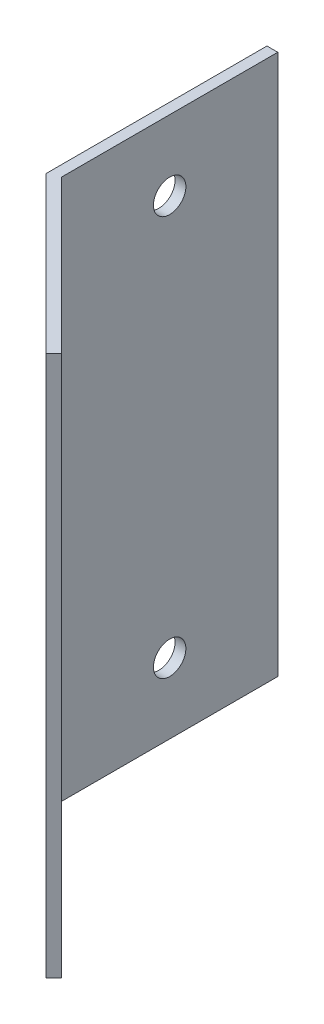
ISO-10303-21;
HEADER;
FILE_DESCRIPTION(('STEP AP214'),'2;1');
FILE_NAME('part.step','',(''),(''),'','','');
FILE_SCHEMA(('AUTOMOTIVE_DESIGN { 1 0 10303 214 1 1 1 1 }'));
ENDSEC;
DATA;
#1=APPLICATION_CONTEXT('core data for automotive mechanical design processes');
#2=APPLICATION_PROTOCOL_DEFINITION('international standard','automotive_design',2000,#1);
#3=PRODUCT_CONTEXT('',#1,'mechanical');
#4=PRODUCT('Part','Part','',(#3));
#5=PRODUCT_RELATED_PRODUCT_CATEGORY('part','',(#4));
#6=PRODUCT_DEFINITION_FORMATION('','',#4);
#7=PRODUCT_DEFINITION_CONTEXT('part definition',#1,'design');
#8=PRODUCT_DEFINITION('design','',#6,#7);
#9=PRODUCT_DEFINITION_SHAPE('','',#8);
#10=(LENGTH_UNIT() NAMED_UNIT(*) SI_UNIT(.MILLI.,.METRE.));
#11=(NAMED_UNIT(*) PLANE_ANGLE_UNIT() SI_UNIT($,.RADIAN.));
#12=(NAMED_UNIT(*) SI_UNIT($,.STERADIAN.) SOLID_ANGLE_UNIT());
#13=UNCERTAINTY_MEASURE_WITH_UNIT(LENGTH_MEASURE(1.E-05),#10,'distance_accuracy_value','');
#14=(GEOMETRIC_REPRESENTATION_CONTEXT(3) GLOBAL_UNCERTAINTY_ASSIGNED_CONTEXT((#13)) GLOBAL_UNIT_ASSIGNED_CONTEXT((#10,
#11,#12)) REPRESENTATION_CONTEXT('',''));
#15=CARTESIAN_POINT('',(0.,0.,0.));
#16=DIRECTION('',(0.,0.,1.));
#17=DIRECTION('',(1.,0.,0.));
#18=AXIS2_PLACEMENT_3D('',#15,#16,#17);
#19=CARTESIAN_POINT('',(14.4350288425444,50.,14.4350288425444));
#20=DIRECTION('',(0.707106781186546,0.,-0.707106781186549));
#21=DIRECTION('',(-0.707106781186549,0.,-0.707106781186546));
#22=AXIS2_PLACEMENT_3D('',#19,#20,#21);
#23=PLANE('',#22);
#24=CARTESIAN_POINT('',(7.36396103067895,6.50000000000001,7.36396103067892));
#25=DIRECTION('',(0.707106781186546,0.,-0.707106781186549));
#26=DIRECTION('',(-0.707106781186549,0.,-0.707106781186546));
#27=AXIS2_PLACEMENT_3D('',#24,#25,#26);
#28=CIRCLE('',#27,1.5);
#29=CARTESIAN_POINT('',(6.30330085889913,6.50000000000001,6.3033008588991));
#30=VERTEX_POINT('',#29);
#31=EDGE_CURVE('E161',#30,#30,#28,.F.);
#32=ORIENTED_EDGE('',*,*,#31,.F.);
#33=EDGE_LOOP('',(#32));
#34=FACE_BOUND('',#33,.T.);
#35=CARTESIAN_POINT('',(7.36396103067895,43.5,7.36396103067892));
#36=DIRECTION('',(0.707106781186546,0.,-0.707106781186549));
#37=DIRECTION('',(-0.707106781186549,0.,-0.707106781186546));
#38=AXIS2_PLACEMENT_3D('',#35,#36,#37);
#39=CIRCLE('',#38,1.5);
#40=CARTESIAN_POINT('',(6.30330085889912,43.5,6.3033008588991));
#41=VERTEX_POINT('',#40);
#42=EDGE_CURVE('E164',#41,#41,#39,.F.);
#43=ORIENTED_EDGE('',*,*,#42,.F.);
#44=EDGE_LOOP('',(#43));
#45=FACE_BOUND('',#44,.T.);
#46=DIRECTION('',(0.707106781186549,0.,0.707106781186546));
#47=VECTOR('',#46,1.);
#48=CARTESIAN_POINT('',(14.4350288425444,0.,14.4350288425444));
#49=LINE('',#48,#47);
#50=CARTESIAN_POINT('',(0.,0.,0.));
#51=VERTEX_POINT('',#50);
#52=CARTESIAN_POINT('',(14.4350288425444,0.,14.4350288425444));
#53=VERTEX_POINT('',#52);
#54=EDGE_CURVE('E115',#51,#53,#49,.T.);
#55=ORIENTED_EDGE('',*,*,#54,.T.);
#56=DIRECTION('',(0.,-1.,0.));
#57=VECTOR('',#56,1.);
#58=CARTESIAN_POINT('',(14.4350288425444,50.,14.4350288425444));
#59=LINE('',#58,#57);
#60=CARTESIAN_POINT('',(14.4350288425444,50.,14.4350288425444));
#61=VERTEX_POINT('',#60);
#62=EDGE_CURVE('E11',#61,#53,#59,.T.);
#63=ORIENTED_EDGE('',*,*,#62,.F.);
#64=DIRECTION('',(0.707106781186549,0.,0.707106781186546));
#65=VECTOR('',#64,1.);
#66=CARTESIAN_POINT('',(14.4350288425444,50.,14.4350288425444));
#67=LINE('',#66,#65);
#68=CARTESIAN_POINT('',(0.,50.,0.));
#69=VERTEX_POINT('',#68);
#70=EDGE_CURVE('E126',#69,#61,#67,.T.);
#71=ORIENTED_EDGE('',*,*,#70,.F.);
#72=DIRECTION('',(0.,-1.,0.));
#73=VECTOR('',#72,1.);
#74=CARTESIAN_POINT('',(0.,50.,0.));
#75=LINE('',#74,#73);
#76=EDGE_CURVE('E111',#69,#51,#75,.T.);
#77=ORIENTED_EDGE('',*,*,#76,.T.);
#78=EDGE_LOOP('',(#55,#63,#71,#77));
#79=FACE_BOUND('',#78,.T.);
#80=ADVANCED_FACE('F31',(#34,#45,#79),#23,.F.);
#81=CARTESIAN_POINT('',(15.142135623731,50.,13.7279220613578));
#82=DIRECTION('',(-0.707106781186548,0.,-0.707106781186548));
#83=DIRECTION('',(-0.707106781186548,0.,0.707106781186548));
#84=AXIS2_PLACEMENT_3D('',#81,#82,#83);
#85=PLANE('',#84);
#86=DIRECTION('',(0.707106781186548,0.,-0.707106781186548));
#87=VECTOR('',#86,1.);
#88=CARTESIAN_POINT('',(15.142135623731,0.,13.7279220613578));
#89=LINE('',#88,#87);
#90=CARTESIAN_POINT('',(15.142135623731,0.,13.7279220613578));
#91=VERTEX_POINT('',#90);
#92=EDGE_CURVE('E118',#53,#91,#89,.T.);
#93=ORIENTED_EDGE('',*,*,#92,.T.);
#94=DIRECTION('',(0.,-1.,0.));
#95=VECTOR('',#94,1.);
#96=CARTESIAN_POINT('',(15.142135623731,50.,13.7279220613578));
#97=LINE('',#96,#95);
#98=CARTESIAN_POINT('',(15.142135623731,50.,13.7279220613578));
#99=VERTEX_POINT('',#98);
#100=EDGE_CURVE('E39',#99,#91,#97,.T.);
#101=ORIENTED_EDGE('',*,*,#100,.F.);
#102=DIRECTION('',(0.707106781186548,0.,-0.707106781186548));
#103=VECTOR('',#102,1.);
#104=CARTESIAN_POINT('',(15.142135623731,50.,13.7279220613578));
#105=LINE('',#104,#103);
#106=EDGE_CURVE('E84',#61,#99,#105,.T.);
#107=ORIENTED_EDGE('',*,*,#106,.F.);
#108=ORIENTED_EDGE('',*,*,#62,.T.);
#109=EDGE_LOOP('',(#93,#101,#107,#108));
#110=FACE_BOUND('',#109,.T.);
#111=ADVANCED_FACE('F153',(#110),#85,.F.);
#112=CARTESIAN_POINT('',(1.,50.,-0.414213562373093));
#113=DIRECTION('',(-0.707106781186546,0.,0.707106781186549));
#114=DIRECTION('',(0.707106781186549,0.,0.707106781186546));
#115=AXIS2_PLACEMENT_3D('',#112,#113,#114);
#116=PLANE('',#115);
#117=CARTESIAN_POINT('',(8.0710678118655,6.50000000000001,6.65685424949237));
#118=DIRECTION('',(0.707106781186546,0.,-0.707106781186549));
#119=DIRECTION('',(0.707106781186549,0.,0.707106781186546));
#120=AXIS2_PLACEMENT_3D('',#117,#118,#119);
#121=CIRCLE('',#120,1.5);
#122=CARTESIAN_POINT('',(9.13172798364532,6.50000000000001,7.71751442127219));
#123=VERTEX_POINT('',#122);
#124=EDGE_CURVE('E210',#123,#123,#121,.T.);
#125=ORIENTED_EDGE('',*,*,#124,.F.);
#126=EDGE_LOOP('',(#125));
#127=FACE_BOUND('',#126,.T.);
#128=CARTESIAN_POINT('',(8.0710678118655,43.5,6.65685424949237));
#129=DIRECTION('',(0.707106781186546,0.,-0.707106781186549));
#130=DIRECTION('',(-0.707106781186549,0.,-0.707106781186546));
#131=AXIS2_PLACEMENT_3D('',#128,#129,#130);
#132=CIRCLE('',#131,1.5);
#133=CARTESIAN_POINT('',(7.01040764008567,43.5,5.59619407771255));
#134=VERTEX_POINT('',#133);
#135=EDGE_CURVE('E167',#134,#134,#132,.T.);
#136=ORIENTED_EDGE('',*,*,#135,.F.);
#137=EDGE_LOOP('',(#136));
#138=FACE_BOUND('',#137,.T.);
#139=DIRECTION('',(-0.707106781186549,0.,-0.707106781186546));
#140=VECTOR('',#139,1.);
#141=CARTESIAN_POINT('',(1.,0.,-0.414213562373093));
#142=LINE('',#141,#140);
#143=CARTESIAN_POINT('',(1.,0.,-0.414213562373093));
#144=VERTEX_POINT('',#143);
#145=EDGE_CURVE('E121',#91,#144,#142,.T.);
#146=ORIENTED_EDGE('',*,*,#145,.T.);
#147=DIRECTION('',(0.,-1.,0.));
#148=VECTOR('',#147,1.);
#149=CARTESIAN_POINT('',(1.,50.,-0.414213562373093));
#150=LINE('',#149,#148);
#151=CARTESIAN_POINT('',(1.,50.,-0.414213562373093));
#152=VERTEX_POINT('',#151);
#153=EDGE_CURVE('E106',#152,#144,#150,.T.);
#154=ORIENTED_EDGE('',*,*,#153,.F.);
#155=DIRECTION('',(-0.707106781186549,0.,-0.707106781186546));
#156=VECTOR('',#155,1.);
#157=CARTESIAN_POINT('',(1.,50.,-0.414213562373093));
#158=LINE('',#157,#156);
#159=EDGE_CURVE('E97',#99,#152,#158,.T.);
#160=ORIENTED_EDGE('',*,*,#159,.F.);
#161=ORIENTED_EDGE('',*,*,#100,.T.);
#162=EDGE_LOOP('',(#146,#154,#160,#161));
#163=FACE_BOUND('',#162,.T.);
#164=ADVANCED_FACE('F132',(#127,#138,#163),#116,.F.);
#165=CARTESIAN_POINT('',(1.,50.,-20.4142135623731));
#166=DIRECTION('',(-1.,0.,0.));
#167=DIRECTION('',(0.,0.,1.));
#168=AXIS2_PLACEMENT_3D('',#165,#166,#167);
#169=PLANE('',#168);
#170=CARTESIAN_POINT('',(1.,43.5,-10.4142135623731));
#171=DIRECTION('',(1.,0.,0.));
#172=DIRECTION('',(0.,0.,1.));
#173=AXIS2_PLACEMENT_3D('',#170,#171,#172);
#174=CIRCLE('',#173,1.5);
#175=CARTESIAN_POINT('',(1.,43.5,-8.91421356237309));
#176=VERTEX_POINT('',#175);
#177=EDGE_CURVE('E166',#176,#176,#174,.T.);
#178=ORIENTED_EDGE('',*,*,#177,.F.);
#179=EDGE_LOOP('',(#178));
#180=FACE_BOUND('',#179,.T.);
#181=CARTESIAN_POINT('',(1.,6.5,-10.4142135623731));
#182=DIRECTION('',(1.,0.,0.));
#183=DIRECTION('',(0.,0.,-1.));
#184=AXIS2_PLACEMENT_3D('',#181,#182,#183);
#185=CIRCLE('',#184,1.5);
#186=CARTESIAN_POINT('',(1.,6.5,-11.9142135623731));
#187=VERTEX_POINT('',#186);
#188=EDGE_CURVE('E178',#187,#187,#185,.T.);
#189=ORIENTED_EDGE('',*,*,#188,.F.);
#190=EDGE_LOOP('',(#189));
#191=FACE_BOUND('',#190,.T.);
#192=DIRECTION('',(0.,0.,-1.));
#193=VECTOR('',#192,1.);
#194=CARTESIAN_POINT('',(1.,0.,-20.4142135623731));
#195=LINE('',#194,#193);
#196=CARTESIAN_POINT('',(1.,0.,-20.4142135623731));
#197=VERTEX_POINT('',#196);
#198=EDGE_CURVE('E105',#144,#197,#195,.T.);
#199=ORIENTED_EDGE('',*,*,#198,.T.);
#200=DIRECTION('',(0.,-1.,0.));
#201=VECTOR('',#200,1.);
#202=CARTESIAN_POINT('',(1.,50.,-20.4142135623731));
#203=LINE('',#202,#201);
#204=CARTESIAN_POINT('',(1.,50.,-20.4142135623731));
#205=VERTEX_POINT('',#204);
#206=EDGE_CURVE('E102',#205,#197,#203,.T.);
#207=ORIENTED_EDGE('',*,*,#206,.F.);
#208=DIRECTION('',(0.,0.,-1.));
#209=VECTOR('',#208,1.);
#210=CARTESIAN_POINT('',(1.,50.,-20.4142135623731));
#211=LINE('',#210,#209);
#212=EDGE_CURVE('E91',#152,#205,#211,.T.);
#213=ORIENTED_EDGE('',*,*,#212,.F.);
#214=ORIENTED_EDGE('',*,*,#153,.T.);
#215=EDGE_LOOP('',(#199,#207,#213,#214));
#216=FACE_BOUND('',#215,.T.);
#217=ADVANCED_FACE('F103',(#180,#191,#216),#169,.F.);
#218=CARTESIAN_POINT('',(0.,50.,-20.4142135623731));
#219=DIRECTION('',(0.,0.,1.));
#220=DIRECTION('',(1.,0.,0.));
#221=AXIS2_PLACEMENT_3D('',#218,#219,#220);
#222=PLANE('',#221);
#223=DIRECTION('',(-1.,0.,0.));
#224=VECTOR('',#223,1.);
#225=CARTESIAN_POINT('',(0.,0.,-20.4142135623731));
#226=LINE('',#225,#224);
#227=CARTESIAN_POINT('',(0.,0.,-20.4142135623731));
#228=VERTEX_POINT('',#227);
#229=EDGE_CURVE('E70',#197,#228,#226,.T.);
#230=ORIENTED_EDGE('',*,*,#229,.T.);
#231=DIRECTION('',(0.,-1.,0.));
#232=VECTOR('',#231,1.);
#233=CARTESIAN_POINT('',(0.,50.,-20.4142135623731));
#234=LINE('',#233,#232);
#235=CARTESIAN_POINT('',(0.,50.,-20.4142135623731));
#236=VERTEX_POINT('',#235);
#237=EDGE_CURVE('E107',#236,#228,#234,.T.);
#238=ORIENTED_EDGE('',*,*,#237,.F.);
#239=DIRECTION('',(-1.,0.,0.));
#240=VECTOR('',#239,1.);
#241=CARTESIAN_POINT('',(0.,50.,-20.4142135623731));
#242=LINE('',#241,#240);
#243=EDGE_CURVE('E95',#205,#236,#242,.T.);
#244=ORIENTED_EDGE('',*,*,#243,.F.);
#245=ORIENTED_EDGE('',*,*,#206,.T.);
#246=EDGE_LOOP('',(#230,#238,#244,#245));
#247=FACE_BOUND('',#246,.T.);
#248=ADVANCED_FACE('F109',(#247),#222,.F.);
#249=CARTESIAN_POINT('',(0.,50.,0.));
#250=DIRECTION('',(1.,0.,0.));
#251=DIRECTION('',(0.,0.,-1.));
#252=AXIS2_PLACEMENT_3D('',#249,#250,#251);
#253=PLANE('',#252);
#254=CARTESIAN_POINT('',(0.,43.5,-10.4142135623731));
#255=DIRECTION('',(1.,0.,0.));
#256=DIRECTION('',(0.,0.,-1.));
#257=AXIS2_PLACEMENT_3D('',#254,#255,#256);
#258=CIRCLE('',#257,1.5);
#259=CARTESIAN_POINT('',(0.,43.5,-11.9142135623731));
#260=VERTEX_POINT('',#259);
#261=EDGE_CURVE('E170',#260,#260,#258,.F.);
#262=ORIENTED_EDGE('',*,*,#261,.F.);
#263=EDGE_LOOP('',(#262));
#264=FACE_BOUND('',#263,.T.);
#265=CARTESIAN_POINT('',(0.,6.5,-10.4142135623731));
#266=DIRECTION('',(1.,0.,0.));
#267=DIRECTION('',(0.,0.,-1.));
#268=AXIS2_PLACEMENT_3D('',#265,#266,#267);
#269=CIRCLE('',#268,1.5);
#270=CARTESIAN_POINT('',(0.,6.5,-11.9142135623731));
#271=VERTEX_POINT('',#270);
#272=EDGE_CURVE('E119',#271,#271,#269,.F.);
#273=ORIENTED_EDGE('',*,*,#272,.F.);
#274=EDGE_LOOP('',(#273));
#275=FACE_BOUND('',#274,.T.);
#276=DIRECTION('',(0.,0.,1.));
#277=VECTOR('',#276,1.);
#278=CARTESIAN_POINT('',(0.,0.,0.));
#279=LINE('',#278,#277);
#280=EDGE_CURVE('E76',#228,#51,#279,.T.);
#281=ORIENTED_EDGE('',*,*,#280,.T.);
#282=ORIENTED_EDGE('',*,*,#76,.F.);
#283=DIRECTION('',(0.,0.,1.));
#284=VECTOR('',#283,1.);
#285=CARTESIAN_POINT('',(0.,50.,0.));
#286=LINE('',#285,#284);
#287=EDGE_CURVE('E47',#236,#69,#286,.T.);
#288=ORIENTED_EDGE('',*,*,#287,.F.);
#289=ORIENTED_EDGE('',*,*,#237,.T.);
#290=EDGE_LOOP('',(#281,#282,#288,#289));
#291=FACE_BOUND('',#290,.T.);
#292=ADVANCED_FACE('F139',(#264,#275,#291),#253,.F.);
#293=CARTESIAN_POINT('',(14.4350288425444,50.,14.4350288425444));
#294=DIRECTION('',(0.,1.,0.));
#295=DIRECTION('',(0.,0.,1.));
#296=AXIS2_PLACEMENT_3D('',#293,#294,#295);
#297=PLANE('',#296);
#298=ORIENTED_EDGE('',*,*,#70,.T.);
#299=ORIENTED_EDGE('',*,*,#106,.T.);
#300=ORIENTED_EDGE('',*,*,#159,.T.);
#301=ORIENTED_EDGE('',*,*,#212,.T.);
#302=ORIENTED_EDGE('',*,*,#243,.T.);
#303=ORIENTED_EDGE('',*,*,#287,.T.);
#304=EDGE_LOOP('',(#298,#299,#300,#301,#302,#303));
#305=FACE_BOUND('',#304,.T.);
#306=ADVANCED_FACE('F93',(#305),#297,.T.);
#307=CARTESIAN_POINT('',(14.4350288425444,0.,14.4350288425444));
#308=DIRECTION('',(0.,1.,0.));
#309=DIRECTION('',(0.,0.,1.));
#310=AXIS2_PLACEMENT_3D('',#307,#308,#309);
#311=PLANE('',#310);
#312=ORIENTED_EDGE('',*,*,#54,.F.);
#313=ORIENTED_EDGE('',*,*,#280,.F.);
#314=ORIENTED_EDGE('',*,*,#229,.F.);
#315=ORIENTED_EDGE('',*,*,#198,.F.);
#316=ORIENTED_EDGE('',*,*,#145,.F.);
#317=ORIENTED_EDGE('',*,*,#92,.F.);
#318=EDGE_LOOP('',(#312,#313,#314,#315,#316,#317));
#319=FACE_BOUND('',#318,.T.);
#320=ADVANCED_FACE('F135',(#319),#311,.F.);
#321=CARTESIAN_POINT('',(-0.00100000000000273,6.5,-10.4142135623731));
#322=DIRECTION('',(1.,0.,0.));
#323=DIRECTION('',(0.,0.,-1.));
#324=AXIS2_PLACEMENT_3D('',#321,#322,#323);
#325=CYLINDRICAL_SURFACE('',#324,1.5);
#326=ORIENTED_EDGE('',*,*,#188,.T.);
#327=EDGE_LOOP('',(#326));
#328=FACE_BOUND('',#327,.T.);
#329=ORIENTED_EDGE('',*,*,#272,.T.);
#330=EDGE_LOOP('',(#329));
#331=FACE_BOUND('',#330,.T.);
#332=ADVANCED_FACE('F186',(#328,#331),#325,.F.);
#333=CARTESIAN_POINT('',(-0.00100000000000273,43.5,-10.4142135623731));
#334=DIRECTION('',(1.,0.,0.));
#335=DIRECTION('',(0.,0.,-1.));
#336=AXIS2_PLACEMENT_3D('',#333,#334,#335);
#337=CYLINDRICAL_SURFACE('',#336,1.5);
#338=ORIENTED_EDGE('',*,*,#177,.T.);
#339=EDGE_LOOP('',(#338));
#340=FACE_BOUND('',#339,.T.);
#341=ORIENTED_EDGE('',*,*,#261,.T.);
#342=EDGE_LOOP('',(#341));
#343=FACE_BOUND('',#342,.T.);
#344=ADVANCED_FACE('F188',(#340,#343),#337,.F.);
#345=CARTESIAN_POINT('',(0.145446609406762,43.5,14.5824754519511));
#346=DIRECTION('',(0.707106781186546,0.,-0.707106781186549));
#347=DIRECTION('',(-0.707106781186549,0.,-0.707106781186546));
#348=AXIS2_PLACEMENT_3D('',#345,#346,#347);
#349=CYLINDRICAL_SURFACE('',#348,1.5);
#350=ORIENTED_EDGE('',*,*,#135,.T.);
#351=EDGE_LOOP('',(#350));
#352=FACE_BOUND('',#351,.T.);
#353=ORIENTED_EDGE('',*,*,#42,.T.);
#354=EDGE_LOOP('',(#353));
#355=FACE_BOUND('',#354,.T.);
#356=ADVANCED_FACE('F195',(#352,#355),#349,.F.);
#357=CARTESIAN_POINT('',(0.145446609406762,6.50000000000001,14.5824754519511));
#358=DIRECTION('',(0.707106781186546,0.,-0.707106781186549));
#359=DIRECTION('',(-0.707106781186549,0.,-0.707106781186546));
#360=AXIS2_PLACEMENT_3D('',#357,#358,#359);
#361=CYLINDRICAL_SURFACE('',#360,1.5);
#362=ORIENTED_EDGE('',*,*,#124,.T.);
#363=EDGE_LOOP('',(#362));
#364=FACE_BOUND('',#363,.T.);
#365=ORIENTED_EDGE('',*,*,#31,.T.);
#366=EDGE_LOOP('',(#365));
#367=FACE_BOUND('',#366,.T.);
#368=ADVANCED_FACE('F201',(#364,#367),#361,.F.);
#369=CLOSED_SHELL('',(#80,#111,#164,#217,#248,#292,#306,#320,#332,#344,#356,#368));
#370=MANIFOLD_SOLID_BREP('B2',#369);
#371=ADVANCED_BREP_SHAPE_REPRESENTATION('',(#18,#370),#14);
#372=SHAPE_DEFINITION_REPRESENTATION(#9,#371);
ENDSEC;
END-ISO-10303-21;
